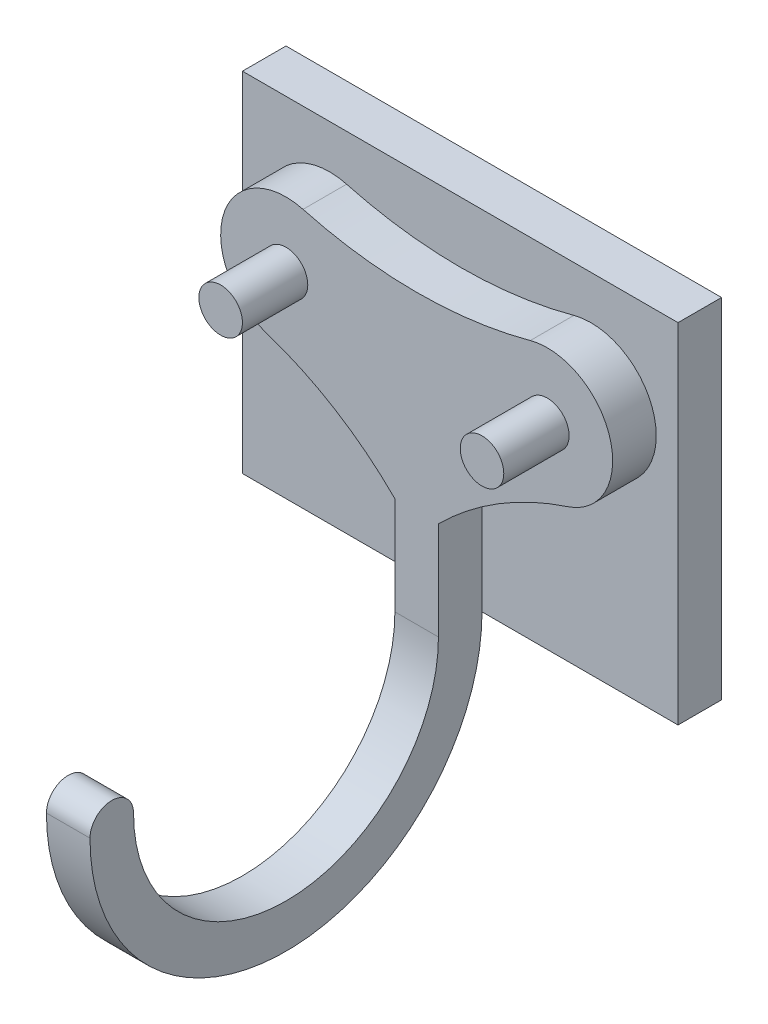
ISO-10303-21;
HEADER;
FILE_DESCRIPTION(('STEP AP214'),'2;1');
FILE_NAME('part.step','',(''),(''),'','','');
FILE_SCHEMA(('AUTOMOTIVE_DESIGN { 1 0 10303 214 1 1 1 1 }'));
ENDSEC;
DATA;
#1=APPLICATION_CONTEXT('core data for automotive mechanical design processes');
#2=APPLICATION_PROTOCOL_DEFINITION('international standard','automotive_design',2000,#1);
#3=PRODUCT_CONTEXT('',#1,'mechanical');
#4=PRODUCT('Part','Part','',(#3));
#5=PRODUCT_RELATED_PRODUCT_CATEGORY('part','',(#4));
#6=PRODUCT_DEFINITION_FORMATION('','',#4);
#7=PRODUCT_DEFINITION_CONTEXT('part definition',#1,'design');
#8=PRODUCT_DEFINITION('design','',#6,#7);
#9=PRODUCT_DEFINITION_SHAPE('','',#8);
#10=(LENGTH_UNIT() NAMED_UNIT(*) SI_UNIT(.MILLI.,.METRE.));
#11=(NAMED_UNIT(*) PLANE_ANGLE_UNIT() SI_UNIT($,.RADIAN.));
#12=(NAMED_UNIT(*) SI_UNIT($,.STERADIAN.) SOLID_ANGLE_UNIT());
#13=UNCERTAINTY_MEASURE_WITH_UNIT(LENGTH_MEASURE(1.E-05),#10,'distance_accuracy_value','');
#14=(GEOMETRIC_REPRESENTATION_CONTEXT(3) GLOBAL_UNCERTAINTY_ASSIGNED_CONTEXT((#13)) GLOBAL_UNIT_ASSIGNED_CONTEXT((#10,
#11,#12)) REPRESENTATION_CONTEXT('',''));
#15=CARTESIAN_POINT('',(0.,0.,0.));
#16=DIRECTION('',(0.,0.,1.));
#17=DIRECTION('',(1.,0.,0.));
#18=AXIS2_PLACEMENT_3D('',#15,#16,#17);
#19=CARTESIAN_POINT('',(-10.,8.,2.));
#20=DIRECTION('',(1.,0.,0.));
#21=DIRECTION('',(0.,0.,-1.));
#22=AXIS2_PLACEMENT_3D('',#19,#20,#21);
#23=PLANE('',#22);
#24=DIRECTION('',(0.,-1.,0.));
#25=VECTOR('',#24,1.);
#26=CARTESIAN_POINT('',(-10.,8.,0.));
#27=LINE('',#26,#25);
#28=CARTESIAN_POINT('',(-10.,8.,0.));
#29=VERTEX_POINT('',#28);
#30=CARTESIAN_POINT('',(-10.,-8.,0.));
#31=VERTEX_POINT('',#30);
#32=EDGE_CURVE('E241',#29,#31,#27,.T.);
#33=ORIENTED_EDGE('',*,*,#32,.T.);
#34=DIRECTION('',(0.,0.,-1.));
#35=VECTOR('',#34,1.);
#36=CARTESIAN_POINT('',(-10.,-8.,2.));
#37=LINE('',#36,#35);
#38=CARTESIAN_POINT('',(-10.,-8.,2.));
#39=VERTEX_POINT('',#38);
#40=EDGE_CURVE('E11',#39,#31,#37,.T.);
#41=ORIENTED_EDGE('',*,*,#40,.F.);
#42=DIRECTION('',(0.,-1.,0.));
#43=VECTOR('',#42,1.);
#44=CARTESIAN_POINT('',(-10.,8.,2.));
#45=LINE('',#44,#43);
#46=CARTESIAN_POINT('',(-10.,8.,2.));
#47=VERTEX_POINT('',#46);
#48=EDGE_CURVE('E242',#47,#39,#45,.T.);
#49=ORIENTED_EDGE('',*,*,#48,.F.);
#50=DIRECTION('',(0.,0.,-1.));
#51=VECTOR('',#50,1.);
#52=CARTESIAN_POINT('',(-10.,8.,2.));
#53=LINE('',#52,#51);
#54=EDGE_CURVE('E256',#47,#29,#53,.T.);
#55=ORIENTED_EDGE('',*,*,#54,.T.);
#56=EDGE_LOOP('',(#33,#41,#49,#55));
#57=FACE_BOUND('',#56,.T.);
#58=ADVANCED_FACE('F42',(#57),#23,.F.);
#59=CARTESIAN_POINT('',(-10.,-8.,2.));
#60=DIRECTION('',(0.,1.,0.));
#61=DIRECTION('',(0.,0.,1.));
#62=AXIS2_PLACEMENT_3D('',#59,#60,#61);
#63=PLANE('',#62);
#64=DIRECTION('',(1.,0.,0.));
#65=VECTOR('',#64,1.);
#66=CARTESIAN_POINT('',(-10.,-8.,2.));
#67=LINE('',#66,#65);
#68=CARTESIAN_POINT('',(1.,-8.,2.));
#69=VERTEX_POINT('',#68);
#70=CARTESIAN_POINT('',(10.,-8.,2.));
#71=VERTEX_POINT('',#70);
#72=EDGE_CURVE('E245',#69,#71,#67,.T.);
#73=ORIENTED_EDGE('',*,*,#72,.F.);
#74=DIRECTION('',(-1.,0.,0.));
#75=VECTOR('',#74,1.);
#76=CARTESIAN_POINT('',(1.,-8.,2.));
#77=LINE('',#76,#75);
#78=CARTESIAN_POINT('',(-1.,-8.,2.));
#79=VERTEX_POINT('',#78);
#80=EDGE_CURVE('E151',#69,#79,#77,.T.);
#81=ORIENTED_EDGE('',*,*,#80,.T.);
#82=EDGE_CURVE('E247',#39,#79,#67,.T.);
#83=ORIENTED_EDGE('',*,*,#82,.F.);
#84=ORIENTED_EDGE('',*,*,#40,.T.);
#85=DIRECTION('',(1.,0.,0.));
#86=VECTOR('',#85,1.);
#87=CARTESIAN_POINT('',(-10.,-8.,0.));
#88=LINE('',#87,#86);
#89=CARTESIAN_POINT('',(10.,-8.,0.));
#90=VERTEX_POINT('',#89);
#91=EDGE_CURVE('E259',#31,#90,#88,.T.);
#92=ORIENTED_EDGE('',*,*,#91,.T.);
#93=DIRECTION('',(0.,0.,-1.));
#94=VECTOR('',#93,1.);
#95=CARTESIAN_POINT('',(10.,-8.,2.));
#96=LINE('',#95,#94);
#97=EDGE_CURVE('E49',#71,#90,#96,.T.);
#98=ORIENTED_EDGE('',*,*,#97,.F.);
#99=EDGE_LOOP('',(#73,#81,#83,#84,#92,#98));
#100=FACE_BOUND('',#99,.T.);
#101=ADVANCED_FACE('F276',(#100),#63,.F.);
#102=CARTESIAN_POINT('',(10.,8.,2.));
#103=DIRECTION('',(1.,0.,0.));
#104=DIRECTION('',(0.,1.,0.));
#105=AXIS2_PLACEMENT_3D('',#102,#103,#104);
#106=PLANE('',#105);
#107=DIRECTION('',(0.,-1.,0.));
#108=VECTOR('',#107,1.);
#109=CARTESIAN_POINT('',(10.,8.,0.));
#110=LINE('',#109,#108);
#111=CARTESIAN_POINT('',(10.,8.,0.));
#112=VERTEX_POINT('',#111);
#113=EDGE_CURVE('E262',#112,#90,#110,.T.);
#114=ORIENTED_EDGE('',*,*,#113,.F.);
#115=DIRECTION('',(0.,0.,-1.));
#116=VECTOR('',#115,1.);
#117=CARTESIAN_POINT('',(10.,8.,2.));
#118=LINE('',#117,#116);
#119=CARTESIAN_POINT('',(10.,8.,2.));
#120=VERTEX_POINT('',#119);
#121=EDGE_CURVE('E268',#120,#112,#118,.T.);
#122=ORIENTED_EDGE('',*,*,#121,.F.);
#123=DIRECTION('',(0.,-1.,0.));
#124=VECTOR('',#123,1.);
#125=CARTESIAN_POINT('',(10.,8.,2.));
#126=LINE('',#125,#124);
#127=EDGE_CURVE('E250',#120,#71,#126,.T.);
#128=ORIENTED_EDGE('',*,*,#127,.T.);
#129=ORIENTED_EDGE('',*,*,#97,.T.);
#130=EDGE_LOOP('',(#114,#122,#128,#129));
#131=FACE_BOUND('',#130,.T.);
#132=ADVANCED_FACE('F272',(#131),#106,.T.);
#133=CARTESIAN_POINT('',(-10.,8.,2.));
#134=DIRECTION('',(0.,1.,0.));
#135=DIRECTION('',(0.,0.,1.));
#136=AXIS2_PLACEMENT_3D('',#133,#134,#135);
#137=PLANE('',#136);
#138=DIRECTION('',(1.,0.,0.));
#139=VECTOR('',#138,1.);
#140=CARTESIAN_POINT('',(-10.,8.,0.));
#141=LINE('',#140,#139);
#142=EDGE_CURVE('E246',#29,#112,#141,.T.);
#143=ORIENTED_EDGE('',*,*,#142,.F.);
#144=ORIENTED_EDGE('',*,*,#54,.F.);
#145=DIRECTION('',(1.,0.,0.));
#146=VECTOR('',#145,1.);
#147=CARTESIAN_POINT('',(-10.,8.,2.));
#148=LINE('',#147,#146);
#149=EDGE_CURVE('E253',#47,#120,#148,.T.);
#150=ORIENTED_EDGE('',*,*,#149,.T.);
#151=ORIENTED_EDGE('',*,*,#121,.T.);
#152=EDGE_LOOP('',(#143,#144,#150,#151));
#153=FACE_BOUND('',#152,.T.);
#154=ADVANCED_FACE('F283',(#153),#137,.T.);
#155=CARTESIAN_POINT('',(0.,0.,2.));
#156=DIRECTION('',(0.,0.,1.));
#157=DIRECTION('',(1.,0.,0.));
#158=AXIS2_PLACEMENT_3D('',#155,#156,#157);
#159=PLANE('',#158);
#160=DIRECTION('',(0.,1.,0.));
#161=VECTOR('',#160,1.);
#162=CARTESIAN_POINT('',(1.,-3.5,2.));
#163=LINE('',#162,#161);
#164=CARTESIAN_POINT('',(1.,-3.5,2.));
#165=VERTEX_POINT('',#164);
#166=EDGE_CURVE('E220',#69,#165,#163,.T.);
#167=ORIENTED_EDGE('',*,*,#166,.F.);
#168=ORIENTED_EDGE('',*,*,#72,.T.);
#169=ORIENTED_EDGE('',*,*,#127,.F.);
#170=ORIENTED_EDGE('',*,*,#149,.F.);
#171=ORIENTED_EDGE('',*,*,#48,.T.);
#172=ORIENTED_EDGE('',*,*,#82,.T.);
#173=DIRECTION('',(0.,-1.,0.));
#174=VECTOR('',#173,1.);
#175=CARTESIAN_POINT('',(-1.,-3.5,2.));
#176=LINE('',#175,#174);
#177=CARTESIAN_POINT('',(-1.,-3.5,2.));
#178=VERTEX_POINT('',#177);
#179=EDGE_CURVE('E217',#178,#79,#176,.T.);
#180=ORIENTED_EDGE('',*,*,#179,.F.);
#181=CARTESIAN_POINT('',(-11.6096362336248,-14.1035663335576,2.));
#182=DIRECTION('',(0.,0.,-1.));
#183=DIRECTION('',(1.,0.,0.));
#184=AXIS2_PLACEMENT_3D('',#181,#182,#183);
#185=CIRCLE('',#184,15.);
#186=CARTESIAN_POINT('',(-6.93493937227081,0.149405611073742,2.));
#187=VERTEX_POINT('',#186);
#188=EDGE_CURVE('E214',#187,#178,#185,.T.);
#189=ORIENTED_EDGE('',*,*,#188,.F.);
#190=CARTESIAN_POINT('',(-6.,3.,2.));
#191=DIRECTION('',(0.,0.,1.));
#192=DIRECTION('',(1.,0.,0.));
#193=AXIS2_PLACEMENT_3D('',#190,#191,#192);
#194=CIRCLE('',#193,3.);
#195=CARTESIAN_POINT('',(-5.21739130434783,5.89612217102276,2.));
#196=VERTEX_POINT('',#195);
#197=EDGE_CURVE('E211',#196,#187,#194,.T.);
#198=ORIENTED_EDGE('',*,*,#197,.F.);
#199=CARTESIAN_POINT('',(0.,25.2036033111745,2.));
#200=DIRECTION('',(0.,0.,-1.));
#201=DIRECTION('',(1.,0.,0.));
#202=AXIS2_PLACEMENT_3D('',#199,#200,#201);
#203=CIRCLE('',#202,20.);
#204=CARTESIAN_POINT('',(5.21739130434783,5.89612217102276,2.));
#205=VERTEX_POINT('',#204);
#206=EDGE_CURVE('E182',#205,#196,#203,.T.);
#207=ORIENTED_EDGE('',*,*,#206,.F.);
#208=CARTESIAN_POINT('',(6.,3.,2.));
#209=DIRECTION('',(0.,0.,1.));
#210=DIRECTION('',(1.,0.,0.));
#211=AXIS2_PLACEMENT_3D('',#208,#209,#210);
#212=CIRCLE('',#211,3.);
#213=CARTESIAN_POINT('',(6.9349393722708,0.149405611073742,2.));
#214=VERTEX_POINT('',#213);
#215=EDGE_CURVE('E61',#214,#205,#212,.T.);
#216=ORIENTED_EDGE('',*,*,#215,.F.);
#217=CARTESIAN_POINT('',(11.6096362336248,-14.1035663335576,2.));
#218=DIRECTION('',(0.,0.,-1.));
#219=DIRECTION('',(1.,0.,0.));
#220=AXIS2_PLACEMENT_3D('',#217,#218,#219);
#221=CIRCLE('',#220,15.);
#222=EDGE_CURVE('E56',#165,#214,#221,.T.);
#223=ORIENTED_EDGE('',*,*,#222,.F.);
#224=EDGE_LOOP('',(#167,#168,#169,#170,#171,#172,#180,#189,#198,#207,#216,#223));
#225=FACE_BOUND('',#224,.T.);
#226=ADVANCED_FACE('F286',(#225),#159,.T.);
#227=CARTESIAN_POINT('',(0.,0.,0.));
#228=DIRECTION('',(0.,0.,1.));
#229=DIRECTION('',(1.,0.,0.));
#230=AXIS2_PLACEMENT_3D('',#227,#228,#229);
#231=PLANE('',#230);
#232=ORIENTED_EDGE('',*,*,#32,.F.);
#233=ORIENTED_EDGE('',*,*,#142,.T.);
#234=ORIENTED_EDGE('',*,*,#113,.T.);
#235=ORIENTED_EDGE('',*,*,#91,.F.);
#236=EDGE_LOOP('',(#232,#233,#234,#235));
#237=FACE_BOUND('',#236,.T.);
#238=ADVANCED_FACE('F280',(#237),#231,.F.);
#239=CARTESIAN_POINT('',(0.,25.2036033111745,4.));
#240=DIRECTION('',(0.,0.,-1.));
#241=DIRECTION('',(-1.,0.,0.));
#242=AXIS2_PLACEMENT_3D('',#239,#240,#241);
#243=CYLINDRICAL_SURFACE('',#242,20.);
#244=ORIENTED_EDGE('',*,*,#206,.T.);
#245=DIRECTION('',(0.,0.,-1.));
#246=VECTOR('',#245,1.);
#247=CARTESIAN_POINT('',(-5.21739130434783,5.89612217102276,4.));
#248=LINE('',#247,#246);
#249=CARTESIAN_POINT('',(-5.21739130434783,5.89612217102276,4.));
#250=VERTEX_POINT('',#249);
#251=EDGE_CURVE('E238',#250,#196,#248,.T.);
#252=ORIENTED_EDGE('',*,*,#251,.F.);
#253=CARTESIAN_POINT('',(0.,25.2036033111745,4.));
#254=DIRECTION('',(0.,0.,-1.));
#255=DIRECTION('',(1.,0.,0.));
#256=AXIS2_PLACEMENT_3D('',#253,#254,#255);
#257=CIRCLE('',#256,20.);
#258=CARTESIAN_POINT('',(5.21739130434783,5.89612217102276,4.));
#259=VERTEX_POINT('',#258);
#260=EDGE_CURVE('E191',#259,#250,#257,.T.);
#261=ORIENTED_EDGE('',*,*,#260,.F.);
#262=DIRECTION('',(0.,0.,-1.));
#263=VECTOR('',#262,1.);
#264=CARTESIAN_POINT('',(5.21739130434783,5.89612217102276,4.));
#265=LINE('',#264,#263);
#266=EDGE_CURVE('E208',#259,#205,#265,.T.);
#267=ORIENTED_EDGE('',*,*,#266,.T.);
#268=EDGE_LOOP('',(#244,#252,#261,#267));
#269=FACE_BOUND('',#268,.T.);
#270=ADVANCED_FACE('F301',(#269),#243,.F.);
#271=CARTESIAN_POINT('',(-6.,3.,4.));
#272=DIRECTION('',(0.,0.,-1.));
#273=DIRECTION('',(-1.,0.,0.));
#274=AXIS2_PLACEMENT_3D('',#271,#272,#273);
#275=CYLINDRICAL_SURFACE('',#274,3.);
#276=ORIENTED_EDGE('',*,*,#197,.T.);
#277=DIRECTION('',(0.,0.,-1.));
#278=VECTOR('',#277,1.);
#279=CARTESIAN_POINT('',(-6.93493937227081,0.149405611073742,4.));
#280=LINE('',#279,#278);
#281=CARTESIAN_POINT('',(-6.93493937227081,0.149405611073742,4.));
#282=VERTEX_POINT('',#281);
#283=EDGE_CURVE('E235',#282,#187,#280,.T.);
#284=ORIENTED_EDGE('',*,*,#283,.F.);
#285=CARTESIAN_POINT('',(-6.,3.,4.));
#286=DIRECTION('',(0.,0.,1.));
#287=DIRECTION('',(1.,0.,0.));
#288=AXIS2_PLACEMENT_3D('',#285,#286,#287);
#289=CIRCLE('',#288,3.);
#290=EDGE_CURVE('E194',#250,#282,#289,.T.);
#291=ORIENTED_EDGE('',*,*,#290,.F.);
#292=ORIENTED_EDGE('',*,*,#251,.T.);
#293=EDGE_LOOP('',(#276,#284,#291,#292));
#294=FACE_BOUND('',#293,.T.);
#295=ADVANCED_FACE('F297',(#294),#275,.T.);
#296=CARTESIAN_POINT('',(-11.6096362336248,-14.1035663335576,4.));
#297=DIRECTION('',(0.,0.,-1.));
#298=DIRECTION('',(-1.,0.,0.));
#299=AXIS2_PLACEMENT_3D('',#296,#297,#298);
#300=CYLINDRICAL_SURFACE('',#299,15.);
#301=ORIENTED_EDGE('',*,*,#188,.T.);
#302=DIRECTION('',(0.,0.,-1.));
#303=VECTOR('',#302,1.);
#304=CARTESIAN_POINT('',(-1.,-3.5,4.));
#305=LINE('',#304,#303);
#306=CARTESIAN_POINT('',(-1.,-3.5,4.));
#307=VERTEX_POINT('',#306);
#308=EDGE_CURVE('E232',#307,#178,#305,.T.);
#309=ORIENTED_EDGE('',*,*,#308,.F.);
#310=CARTESIAN_POINT('',(-11.6096362336248,-14.1035663335576,4.));
#311=DIRECTION('',(0.,0.,-1.));
#312=DIRECTION('',(1.,0.,0.));
#313=AXIS2_PLACEMENT_3D('',#310,#311,#312);
#314=CIRCLE('',#313,15.);
#315=EDGE_CURVE('E196',#282,#307,#314,.T.);
#316=ORIENTED_EDGE('',*,*,#315,.F.);
#317=ORIENTED_EDGE('',*,*,#283,.T.);
#318=EDGE_LOOP('',(#301,#309,#316,#317));
#319=FACE_BOUND('',#318,.T.);
#320=ADVANCED_FACE('F294',(#319),#300,.F.);
#321=CARTESIAN_POINT('',(-1.,-3.5,4.));
#322=DIRECTION('',(1.,0.,0.));
#323=DIRECTION('',(0.,1.,0.));
#324=AXIS2_PLACEMENT_3D('',#321,#322,#323);
#325=PLANE('',#324);
#326=ORIENTED_EDGE('',*,*,#179,.T.);
#327=CARTESIAN_POINT('',(-1.,-8.,11.));
#328=DIRECTION('',(-1.,0.,0.));
#329=DIRECTION('',(0.,-1.,0.));
#330=AXIS2_PLACEMENT_3D('',#327,#328,#329);
#331=CIRCLE('',#330,9.);
#332=CARTESIAN_POINT('',(-1.,-8.,20.));
#333=VERTEX_POINT('',#332);
#334=EDGE_CURVE('E166',#79,#333,#331,.T.);
#335=ORIENTED_EDGE('',*,*,#334,.T.);
#336=CARTESIAN_POINT('',(-1.,-8.,19.));
#337=DIRECTION('',(-1.,0.,0.));
#338=DIRECTION('',(0.,-1.,0.));
#339=AXIS2_PLACEMENT_3D('',#336,#337,#338);
#340=CIRCLE('',#339,1.);
#341=CARTESIAN_POINT('',(-1.,-8.,18.));
#342=VERTEX_POINT('',#341);
#343=EDGE_CURVE('E172',#333,#342,#340,.T.);
#344=ORIENTED_EDGE('',*,*,#343,.T.);
#345=CARTESIAN_POINT('',(-1.,-8.,11.));
#346=DIRECTION('',(1.,0.,0.));
#347=DIRECTION('',(0.,-1.,0.));
#348=AXIS2_PLACEMENT_3D('',#345,#346,#347);
#349=CIRCLE('',#348,7.);
#350=CARTESIAN_POINT('',(-1.,-8.,4.));
#351=VERTEX_POINT('',#350);
#352=EDGE_CURVE('E146',#342,#351,#349,.T.);
#353=ORIENTED_EDGE('',*,*,#352,.T.);
#354=DIRECTION('',(0.,-1.,0.));
#355=VECTOR('',#354,1.);
#356=CARTESIAN_POINT('',(-1.,-3.5,4.));
#357=LINE('',#356,#355);
#358=EDGE_CURVE('E198',#307,#351,#357,.T.);
#359=ORIENTED_EDGE('',*,*,#358,.F.);
#360=ORIENTED_EDGE('',*,*,#308,.T.);
#361=EDGE_LOOP('',(#326,#335,#344,#353,#359,#360));
#362=FACE_BOUND('',#361,.T.);
#363=ADVANCED_FACE('F289',(#362),#325,.F.);
#364=CARTESIAN_POINT('',(1.,-3.5,4.));
#365=DIRECTION('',(-1.,0.,0.));
#366=DIRECTION('',(0.,-1.,0.));
#367=AXIS2_PLACEMENT_3D('',#364,#365,#366);
#368=PLANE('',#367);
#369=ORIENTED_EDGE('',*,*,#166,.T.);
#370=DIRECTION('',(0.,0.,-1.));
#371=VECTOR('',#370,1.);
#372=CARTESIAN_POINT('',(1.,-3.5,4.));
#373=LINE('',#372,#371);
#374=CARTESIAN_POINT('',(1.,-3.5,4.));
#375=VERTEX_POINT('',#374);
#376=EDGE_CURVE('E229',#375,#165,#373,.T.);
#377=ORIENTED_EDGE('',*,*,#376,.F.);
#378=DIRECTION('',(0.,1.,0.));
#379=VECTOR('',#378,1.);
#380=CARTESIAN_POINT('',(1.,-3.5,4.));
#381=LINE('',#380,#379);
#382=CARTESIAN_POINT('',(1.,-8.,4.));
#383=VERTEX_POINT('',#382);
#384=EDGE_CURVE('E162',#383,#375,#381,.T.);
#385=ORIENTED_EDGE('',*,*,#384,.F.);
#386=CARTESIAN_POINT('',(1.,-8.,11.));
#387=DIRECTION('',(1.,0.,0.));
#388=DIRECTION('',(0.,-1.,0.));
#389=AXIS2_PLACEMENT_3D('',#386,#387,#388);
#390=CIRCLE('',#389,7.);
#391=CARTESIAN_POINT('',(1.,-8.,18.));
#392=VERTEX_POINT('',#391);
#393=EDGE_CURVE('E143',#392,#383,#390,.T.);
#394=ORIENTED_EDGE('',*,*,#393,.F.);
#395=CARTESIAN_POINT('',(1.,-8.,19.));
#396=DIRECTION('',(-1.,0.,0.));
#397=DIRECTION('',(0.,-1.,0.));
#398=AXIS2_PLACEMENT_3D('',#395,#396,#397);
#399=CIRCLE('',#398,1.);
#400=CARTESIAN_POINT('',(1.,-8.,20.));
#401=VERTEX_POINT('',#400);
#402=EDGE_CURVE('E159',#401,#392,#399,.T.);
#403=ORIENTED_EDGE('',*,*,#402,.F.);
#404=CARTESIAN_POINT('',(1.,-8.,11.));
#405=DIRECTION('',(-1.,0.,0.));
#406=DIRECTION('',(0.,-1.,0.));
#407=AXIS2_PLACEMENT_3D('',#404,#405,#406);
#408=CIRCLE('',#407,9.);
#409=EDGE_CURVE('E152',#69,#401,#408,.T.);
#410=ORIENTED_EDGE('',*,*,#409,.F.);
#411=EDGE_LOOP('',(#369,#377,#385,#394,#403,#410));
#412=FACE_BOUND('',#411,.T.);
#413=ADVANCED_FACE('F157',(#412),#368,.F.);
#414=CARTESIAN_POINT('',(11.6096362336248,-14.1035663335576,4.));
#415=DIRECTION('',(0.,0.,-1.));
#416=DIRECTION('',(-1.,0.,0.));
#417=AXIS2_PLACEMENT_3D('',#414,#415,#416);
#418=CYLINDRICAL_SURFACE('',#417,15.);
#419=ORIENTED_EDGE('',*,*,#222,.T.);
#420=DIRECTION('',(0.,0.,-1.));
#421=VECTOR('',#420,1.);
#422=CARTESIAN_POINT('',(6.9349393722708,0.149405611073742,4.));
#423=LINE('',#422,#421);
#424=CARTESIAN_POINT('',(6.9349393722708,0.149405611073742,4.));
#425=VERTEX_POINT('',#424);
#426=EDGE_CURVE('E226',#425,#214,#423,.T.);
#427=ORIENTED_EDGE('',*,*,#426,.F.);
#428=CARTESIAN_POINT('',(11.6096362336248,-14.1035663335576,4.));
#429=DIRECTION('',(0.,0.,-1.));
#430=DIRECTION('',(1.,0.,0.));
#431=AXIS2_PLACEMENT_3D('',#428,#429,#430);
#432=CIRCLE('',#431,15.);
#433=EDGE_CURVE('E204',#375,#425,#432,.T.);
#434=ORIENTED_EDGE('',*,*,#433,.F.);
#435=ORIENTED_EDGE('',*,*,#376,.T.);
#436=EDGE_LOOP('',(#419,#427,#434,#435));
#437=FACE_BOUND('',#436,.T.);
#438=ADVANCED_FACE('F309',(#437),#418,.F.);
#439=CARTESIAN_POINT('',(6.,3.,4.));
#440=DIRECTION('',(0.,0.,-1.));
#441=DIRECTION('',(-1.,0.,0.));
#442=AXIS2_PLACEMENT_3D('',#439,#440,#441);
#443=CYLINDRICAL_SURFACE('',#442,3.);
#444=ORIENTED_EDGE('',*,*,#215,.T.);
#445=ORIENTED_EDGE('',*,*,#266,.F.);
#446=CARTESIAN_POINT('',(6.,3.,4.));
#447=DIRECTION('',(0.,0.,1.));
#448=DIRECTION('',(1.,0.,0.));
#449=AXIS2_PLACEMENT_3D('',#446,#447,#448);
#450=CIRCLE('',#449,3.);
#451=EDGE_CURVE('E206',#425,#259,#450,.T.);
#452=ORIENTED_EDGE('',*,*,#451,.F.);
#453=ORIENTED_EDGE('',*,*,#426,.T.);
#454=EDGE_LOOP('',(#444,#445,#452,#453));
#455=FACE_BOUND('',#454,.T.);
#456=ADVANCED_FACE('F304',(#455),#443,.T.);
#457=CARTESIAN_POINT('',(0.,25.2036033111745,4.));
#458=DIRECTION('',(0.,0.,1.));
#459=DIRECTION('',(1.,0.,0.));
#460=AXIS2_PLACEMENT_3D('',#457,#458,#459);
#461=PLANE('',#460);
#462=CARTESIAN_POINT('',(-6.,3.,4.));
#463=DIRECTION('',(0.,0.,1.));
#464=DIRECTION('',(1.,0.,0.));
#465=AXIS2_PLACEMENT_3D('',#462,#463,#464);
#466=CIRCLE('',#465,1.);
#467=CARTESIAN_POINT('',(-5.,3.,4.));
#468=VERTEX_POINT('',#467);
#469=EDGE_CURVE('E183',#468,#468,#466,.T.);
#470=ORIENTED_EDGE('',*,*,#469,.F.);
#471=EDGE_LOOP('',(#470));
#472=FACE_BOUND('',#471,.T.);
#473=CARTESIAN_POINT('',(6.,3.,4.));
#474=DIRECTION('',(0.,0.,1.));
#475=DIRECTION('',(1.,0.,0.));
#476=AXIS2_PLACEMENT_3D('',#473,#474,#475);
#477=CIRCLE('',#476,1.);
#478=CARTESIAN_POINT('',(7.,3.,4.));
#479=VERTEX_POINT('',#478);
#480=EDGE_CURVE('E186',#479,#479,#477,.T.);
#481=ORIENTED_EDGE('',*,*,#480,.F.);
#482=EDGE_LOOP('',(#481));
#483=FACE_BOUND('',#482,.T.);
#484=ORIENTED_EDGE('',*,*,#260,.T.);
#485=ORIENTED_EDGE('',*,*,#290,.T.);
#486=ORIENTED_EDGE('',*,*,#315,.T.);
#487=ORIENTED_EDGE('',*,*,#358,.T.);
#488=DIRECTION('',(1.,0.,0.));
#489=VECTOR('',#488,1.);
#490=CARTESIAN_POINT('',(-1.,-8.,4.));
#491=LINE('',#490,#489);
#492=EDGE_CURVE('E201',#351,#383,#491,.T.);
#493=ORIENTED_EDGE('',*,*,#492,.T.);
#494=ORIENTED_EDGE('',*,*,#384,.T.);
#495=ORIENTED_EDGE('',*,*,#433,.T.);
#496=ORIENTED_EDGE('',*,*,#451,.T.);
#497=EDGE_LOOP('',(#484,#485,#486,#487,#493,#494,#495,#496));
#498=FACE_BOUND('',#497,.T.);
#499=ADVANCED_FACE('F312',(#472,#483,#498),#461,.T.);
#500=CARTESIAN_POINT('',(6.,3.,7.));
#501=DIRECTION('',(0.,0.,-1.));
#502=DIRECTION('',(-1.,0.,0.));
#503=AXIS2_PLACEMENT_3D('',#500,#501,#502);
#504=CYLINDRICAL_SURFACE('',#503,1.);
#505=CARTESIAN_POINT('',(6.,3.,7.));
#506=DIRECTION('',(0.,0.,1.));
#507=DIRECTION('',(1.,0.,0.));
#508=AXIS2_PLACEMENT_3D('',#505,#506,#507);
#509=CIRCLE('',#508,1.);
#510=CARTESIAN_POINT('',(7.,3.,7.));
#511=VERTEX_POINT('',#510);
#512=EDGE_CURVE('E176',#511,#511,#509,.T.);
#513=ORIENTED_EDGE('',*,*,#512,.F.);
#514=EDGE_LOOP('',(#513));
#515=FACE_BOUND('',#514,.T.);
#516=ORIENTED_EDGE('',*,*,#480,.T.);
#517=EDGE_LOOP('',(#516));
#518=FACE_BOUND('',#517,.T.);
#519=ADVANCED_FACE('F314',(#515,#518),#504,.T.);
#520=CARTESIAN_POINT('',(6.,3.,7.));
#521=DIRECTION('',(0.,0.,1.));
#522=DIRECTION('',(1.,0.,0.));
#523=AXIS2_PLACEMENT_3D('',#520,#521,#522);
#524=PLANE('',#523);
#525=ORIENTED_EDGE('',*,*,#512,.T.);
#526=EDGE_LOOP('',(#525));
#527=FACE_BOUND('',#526,.T.);
#528=ADVANCED_FACE('F322',(#527),#524,.T.);
#529=CARTESIAN_POINT('',(-6.,3.,7.));
#530=DIRECTION('',(0.,0.,-1.));
#531=DIRECTION('',(-1.,0.,0.));
#532=AXIS2_PLACEMENT_3D('',#529,#530,#531);
#533=CYLINDRICAL_SURFACE('',#532,1.);
#534=CARTESIAN_POINT('',(-6.,3.,7.));
#535=DIRECTION('',(0.,0.,1.));
#536=DIRECTION('',(1.,0.,0.));
#537=AXIS2_PLACEMENT_3D('',#534,#535,#536);
#538=CIRCLE('',#537,1.);
#539=CARTESIAN_POINT('',(-5.,3.,7.));
#540=VERTEX_POINT('',#539);
#541=EDGE_CURVE('E179',#540,#540,#538,.T.);
#542=ORIENTED_EDGE('',*,*,#541,.F.);
#543=EDGE_LOOP('',(#542));
#544=FACE_BOUND('',#543,.T.);
#545=ORIENTED_EDGE('',*,*,#469,.T.);
#546=EDGE_LOOP('',(#545));
#547=FACE_BOUND('',#546,.T.);
#548=ADVANCED_FACE('F379',(#544,#547),#533,.T.);
#549=CARTESIAN_POINT('',(-6.,3.,7.));
#550=DIRECTION('',(0.,0.,1.));
#551=DIRECTION('',(1.,0.,0.));
#552=AXIS2_PLACEMENT_3D('',#549,#550,#551);
#553=PLANE('',#552);
#554=ORIENTED_EDGE('',*,*,#541,.T.);
#555=EDGE_LOOP('',(#554));
#556=FACE_BOUND('',#555,.T.);
#557=ADVANCED_FACE('F386',(#556),#553,.T.);
#558=CARTESIAN_POINT('',(1.,-8.,19.));
#559=DIRECTION('',(-1.,0.,0.));
#560=DIRECTION('',(0.,-1.,0.));
#561=AXIS2_PLACEMENT_3D('',#558,#559,#560);
#562=CYLINDRICAL_SURFACE('',#561,1.);
#563=ORIENTED_EDGE('',*,*,#343,.F.);
#564=DIRECTION('',(-1.,0.,0.));
#565=VECTOR('',#564,1.);
#566=CARTESIAN_POINT('',(1.,-8.,20.));
#567=LINE('',#566,#565);
#568=EDGE_CURVE('E165',#401,#333,#567,.T.);
#569=ORIENTED_EDGE('',*,*,#568,.F.);
#570=ORIENTED_EDGE('',*,*,#402,.T.);
#571=DIRECTION('',(-1.,0.,0.));
#572=VECTOR('',#571,1.);
#573=CARTESIAN_POINT('',(1.,-8.,18.));
#574=LINE('',#573,#572);
#575=EDGE_CURVE('E140',#392,#342,#574,.T.);
#576=ORIENTED_EDGE('',*,*,#575,.T.);
#577=EDGE_LOOP('',(#563,#569,#570,#576));
#578=FACE_BOUND('',#577,.T.);
#579=ADVANCED_FACE('F164',(#578),#562,.T.);
#580=CARTESIAN_POINT('',(1.,-8.,11.));
#581=DIRECTION('',(-1.,0.,0.));
#582=DIRECTION('',(0.,-1.,0.));
#583=AXIS2_PLACEMENT_3D('',#580,#581,#582);
#584=CYLINDRICAL_SURFACE('',#583,9.);
#585=ORIENTED_EDGE('',*,*,#334,.F.);
#586=ORIENTED_EDGE('',*,*,#80,.F.);
#587=ORIENTED_EDGE('',*,*,#409,.T.);
#588=ORIENTED_EDGE('',*,*,#568,.T.);
#589=EDGE_LOOP('',(#585,#586,#587,#588));
#590=FACE_BOUND('',#589,.T.);
#591=ADVANCED_FACE('F310',(#590),#584,.T.);
#592=CARTESIAN_POINT('',(1.,-8.,11.));
#593=DIRECTION('',(-1.,0.,0.));
#594=DIRECTION('',(0.,-1.,0.));
#595=AXIS2_PLACEMENT_3D('',#592,#593,#594);
#596=CYLINDRICAL_SURFACE('',#595,7.);
#597=ORIENTED_EDGE('',*,*,#352,.F.);
#598=ORIENTED_EDGE('',*,*,#575,.F.);
#599=ORIENTED_EDGE('',*,*,#393,.T.);
#600=ORIENTED_EDGE('',*,*,#492,.F.);
#601=EDGE_LOOP('',(#597,#598,#599,#600));
#602=FACE_BOUND('',#601,.T.);
#603=ADVANCED_FACE('F142',(#602),#596,.F.);
#604=CLOSED_SHELL('',(#58,#101,#132,#154,#226,#238,#270,#295,#320,#363,#413,#438,#456,#499,#519,
#528,#548,#557,#579,#591,#603));
#605=MANIFOLD_SOLID_BREP('B2',#604);
#606=ADVANCED_BREP_SHAPE_REPRESENTATION('',(#18,#605),#14);
#607=SHAPE_DEFINITION_REPRESENTATION(#9,#606);
ENDSEC;
END-ISO-10303-21;
